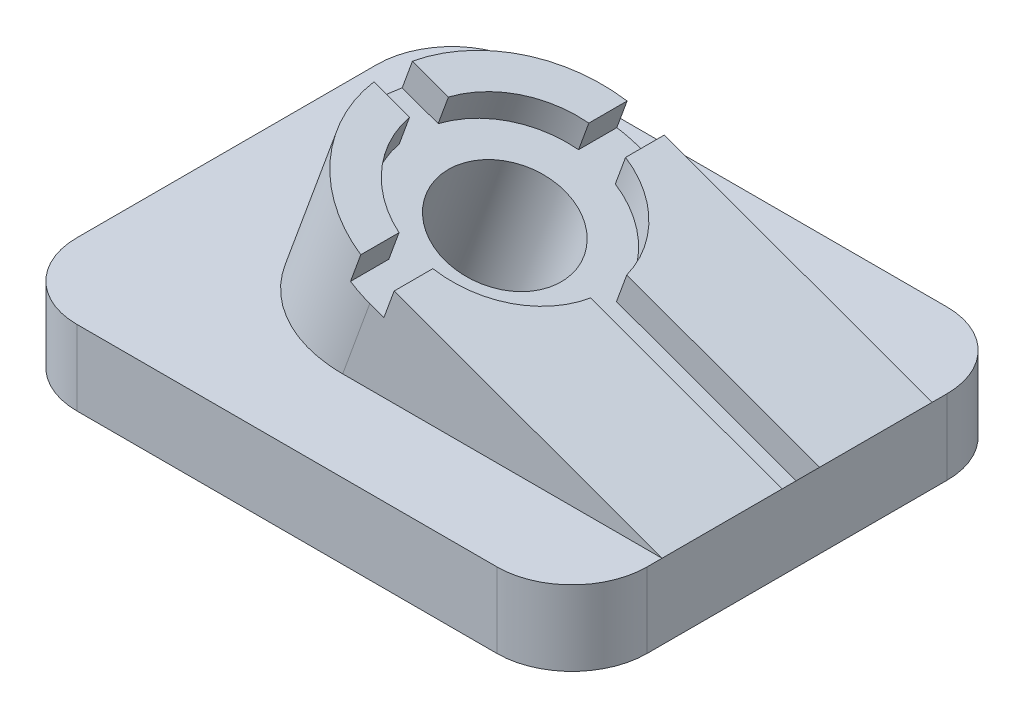
ISO-10303-21;
HEADER;
FILE_DESCRIPTION(('STEP AP214'),'2;1');
FILE_NAME('part.step','',(''),(''),'','','');
FILE_SCHEMA(('AUTOMOTIVE_DESIGN { 1 0 10303 214 1 1 1 1 }'));
ENDSEC;
DATA;
#1=APPLICATION_CONTEXT('core data for automotive mechanical design processes');
#2=APPLICATION_PROTOCOL_DEFINITION('international standard','automotive_design',2000,#1);
#3=PRODUCT_CONTEXT('',#1,'mechanical');
#4=PRODUCT('Part','Part','',(#3));
#5=PRODUCT_RELATED_PRODUCT_CATEGORY('part','',(#4));
#6=PRODUCT_DEFINITION_FORMATION('','',#4);
#7=PRODUCT_DEFINITION_CONTEXT('part definition',#1,'design');
#8=PRODUCT_DEFINITION('design','',#6,#7);
#9=PRODUCT_DEFINITION_SHAPE('','',#8);
#10=(LENGTH_UNIT() NAMED_UNIT(*) SI_UNIT(.MILLI.,.METRE.));
#11=(NAMED_UNIT(*) PLANE_ANGLE_UNIT() SI_UNIT($,.RADIAN.));
#12=(NAMED_UNIT(*) SI_UNIT($,.STERADIAN.) SOLID_ANGLE_UNIT());
#13=UNCERTAINTY_MEASURE_WITH_UNIT(LENGTH_MEASURE(1.E-05),#10,'distance_accuracy_value','');
#14=(GEOMETRIC_REPRESENTATION_CONTEXT(3) GLOBAL_UNCERTAINTY_ASSIGNED_CONTEXT((#13)) GLOBAL_UNIT_ASSIGNED_CONTEXT((#10,
#11,#12)) REPRESENTATION_CONTEXT('',''));
#15=CARTESIAN_POINT('',(0.,0.,0.));
#16=DIRECTION('',(0.,0.,1.));
#17=DIRECTION('',(1.,0.,0.));
#18=AXIS2_PLACEMENT_3D('',#15,#16,#17);
#19=CARTESIAN_POINT('',(6.0521246049556,16.6280756918416,18.));
#20=DIRECTION('',(-0.342020143325663,-0.93969262078591,0.));
#21=DIRECTION('',(0.939692620785911,-0.342020143325663,0.));
#22=AXIS2_PLACEMENT_3D('',#19,#20,#21);
#23=PLANE('',#22);
#24=DIRECTION('',(0.,0.,-1.));
#25=VECTOR('',#24,1.);
#26=CARTESIAN_POINT('',(-2.40678269379413,19.7068661630035,0.));
#27=LINE('',#26,#25);
#28=CARTESIAN_POINT('',(-2.40678269379413,19.7068661630035,17.7482393492988));
#29=VERTEX_POINT('',#28);
#30=CARTESIAN_POINT('',(-2.40678269379413,19.7068661630035,12.6491106406735));
#31=VERTEX_POINT('',#30);
#32=EDGE_CURVE('E263',#29,#31,#27,.T.);
#33=ORIENTED_EDGE('',*,*,#32,.T.);
#34=CARTESIAN_POINT('',(0.412295168563595,18.6808057330265,0.));
#35=DIRECTION('',(0.342020143325663,0.939692620785911,0.));
#36=DIRECTION('',(-0.93969262078591,0.342020143325663,0.));
#37=AXIS2_PLACEMENT_3D('',#34,#35,#36);
#38=CIRCLE('',#37,13.);
#39=CARTESIAN_POINT('',(-11.6582750978868,23.0741340206331,2.));
#40=VERTEX_POINT('',#39);
#41=EDGE_CURVE('E329',#40,#31,#38,.T.);
#42=ORIENTED_EDGE('',*,*,#41,.F.);
#43=DIRECTION('',(-0.93969262078591,0.342020143325663,0.));
#44=VECTOR('',#43,1.);
#45=CARTESIAN_POINT('',(6.0521246049556,16.6280756918416,2.));
#46=LINE('',#45,#44);
#47=CARTESIAN_POINT('',(-16.3974374556942,24.7990480542298,2.));
#48=VERTEX_POINT('',#47);
#49=EDGE_CURVE('E326',#40,#48,#46,.T.);
#50=ORIENTED_EDGE('',*,*,#49,.T.);
#51=CARTESIAN_POINT('',(0.412295168563595,18.6808057330265,0.));
#52=DIRECTION('',(0.342020143325663,0.939692620785911,0.));
#53=DIRECTION('',(-0.93969262078591,0.342020143325663,0.));
#54=AXIS2_PLACEMENT_3D('',#51,#52,#53);
#55=CIRCLE('',#54,18.);
#56=EDGE_CURVE('E370',#48,#29,#55,.T.);
#57=ORIENTED_EDGE('',*,*,#56,.T.);
#58=EDGE_LOOP('',(#33,#42,#50,#57));
#59=FACE_BOUND('',#58,.T.);
#60=ADVANCED_FACE('F58',(#59),#23,.F.);
#61=CARTESIAN_POINT('',(-2.40678269379413,19.7068661630035,-17.7482393492988));
#62=VERTEX_POINT('',#61);
#63=CARTESIAN_POINT('',(-16.2655943799147,24.7510610990519,-3.));
#64=VERTEX_POINT('',#63);
#65=EDGE_CURVE('E378',#62,#64,#55,.T.);
#66=ORIENTED_EDGE('',*,*,#65,.T.);
#67=DIRECTION('',(-0.93969262078591,0.342020143325663,0.));
#68=VECTOR('',#67,1.);
#69=CARTESIAN_POINT('',(6.0521246049556,16.6280756918416,-3.));
#70=LINE('',#69,#68);
#71=CARTESIAN_POINT('',(-11.4739807599818,23.0070563672919,-3.));
#72=VERTEX_POINT('',#71);
#73=EDGE_CURVE('E324',#72,#64,#70,.T.);
#74=ORIENTED_EDGE('',*,*,#73,.F.);
#75=CARTESIAN_POINT('',(0.412295168563595,18.6808057330265,0.));
#76=DIRECTION('',(0.342020143325663,0.939692620785911,0.));
#77=DIRECTION('',(-0.93969262078591,0.342020143325663,0.));
#78=AXIS2_PLACEMENT_3D('',#75,#76,#77);
#79=CIRCLE('',#78,13.);
#80=CARTESIAN_POINT('',(-2.40678269379413,19.7068661630035,-12.6491106406735));
#81=VERTEX_POINT('',#80);
#82=EDGE_CURVE('E321',#81,#72,#79,.T.);
#83=ORIENTED_EDGE('',*,*,#82,.F.);
#84=DIRECTION('',(0.,0.,-1.));
#85=VECTOR('',#84,1.);
#86=CARTESIAN_POINT('',(-2.40678269379413,19.7068661630035,0.));
#87=LINE('',#86,#85);
#88=EDGE_CURVE('E318',#81,#62,#87,.T.);
#89=ORIENTED_EDGE('',*,*,#88,.T.);
#90=EDGE_LOOP('',(#66,#74,#83,#89));
#91=FACE_BOUND('',#90,.T.);
#92=ADVANCED_FACE('F534',(#91),#23,.F.);
#93=DIRECTION('',(-0.939692620785911,0.342020143325663,0.));
#94=VECTOR('',#93,1.);
#95=CARTESIAN_POINT('',(6.0521246049556,16.6280756918416,-18.));
#96=LINE('',#95,#94);
#97=CARTESIAN_POINT('',(38.,5.00000000000002,-18.));
#98=VERTEX_POINT('',#97);
#99=CARTESIAN_POINT('',(2.29168041013542,17.9967654463752,-18.));
#100=VERTEX_POINT('',#99);
#101=EDGE_CURVE('E374',#98,#100,#96,.T.);
#102=ORIENTED_EDGE('',*,*,#101,.T.);
#103=DIRECTION('',(0.,0.,-1.));
#104=VECTOR('',#103,1.);
#105=CARTESIAN_POINT('',(2.29168041013542,17.9967654463752,0.));
#106=LINE('',#105,#104);
#107=CARTESIAN_POINT('',(2.29168041013542,17.9967654463752,-12.8452325786651));
#108=VERTEX_POINT('',#107);
#109=EDGE_CURVE('E316',#108,#100,#106,.T.);
#110=ORIENTED_EDGE('',*,*,#109,.F.);
#111=CARTESIAN_POINT('',(0.412295168563595,18.6808057330266,0.));
#112=DIRECTION('',(0.342020143325663,0.939692620785911,0.));
#113=DIRECTION('',(-0.93969262078591,0.342020143325663,0.));
#114=AXIS2_PLACEMENT_3D('',#111,#112,#113);
#115=CIRCLE('',#114,13.);
#116=CARTESIAN_POINT('',(12.298571097109,14.3545550987612,-3.));
#117=VERTEX_POINT('',#116);
#118=EDGE_CURVE('E313',#117,#108,#115,.T.);
#119=ORIENTED_EDGE('',*,*,#118,.F.);
#120=DIRECTION('',(-0.93969262078591,0.342020143325663,0.));
#121=VECTOR('',#120,1.);
#122=CARTESIAN_POINT('',(6.0521246049556,16.6280756918416,-3.));
#123=LINE('',#122,#121);
#124=CARTESIAN_POINT('',(38.,5.00000000000002,-3.));
#125=VERTEX_POINT('',#124);
#126=EDGE_CURVE('E310',#125,#117,#123,.T.);
#127=ORIENTED_EDGE('',*,*,#126,.F.);
#128=DIRECTION('',(0.,0.,-1.));
#129=VECTOR('',#128,1.);
#130=CARTESIAN_POINT('',(38.,5.00000000000002,18.));
#131=LINE('',#130,#129);
#132=EDGE_CURVE('E388',#125,#98,#131,.T.);
#133=ORIENTED_EDGE('',*,*,#132,.T.);
#134=EDGE_LOOP('',(#102,#110,#119,#127,#133));
#135=FACE_BOUND('',#134,.T.);
#136=ADVANCED_FACE('F505',(#135),#23,.F.);
#137=CARTESIAN_POINT('',(-14.6732677663042,-22.766437790285,0.));
#138=DIRECTION('',(0.342020143325663,0.939692620785911,0.));
#139=DIRECTION('',(-0.939692620785911,0.342020143325663,0.));
#140=AXIS2_PLACEMENT_3D('',#137,#138,#139);
#141=CYLINDRICAL_SURFACE('',#140,18.);
#142=ORIENTED_EDGE('',*,*,#65,.F.);
#143=DIRECTION('',(0.342020143325663,0.939692620785911,0.));
#144=VECTOR('',#143,1.);
#145=CARTESIAN_POINT('',(-3.77486326709679,15.9480956798599,-17.7482393492988));
#146=LINE('',#145,#144);
#147=CARTESIAN_POINT('',(-3.77486326709679,15.9480956798599,-17.7482393492988));
#148=VERTEX_POINT('',#147);
#149=EDGE_CURVE('E353',#148,#62,#146,.T.);
#150=ORIENTED_EDGE('',*,*,#149,.F.);
#151=CARTESIAN_POINT('',(-0.955785404739057,14.9220352498829,0.));
#152=DIRECTION('',(0.342020143325663,0.939692620785911,0.));
#153=DIRECTION('',(-0.93969262078591,0.342020143325663,0.));
#154=AXIS2_PLACEMENT_3D('',#151,#152,#153);
#155=CIRCLE('',#154,18.);
#156=CARTESIAN_POINT('',(-0.955785404739058,14.9220352498829,-18.));
#157=VERTEX_POINT('',#156);
#158=EDGE_CURVE('E281',#157,#148,#155,.T.);
#159=ORIENTED_EDGE('',*,*,#158,.F.);
#160=DIRECTION('',(0.342020143325663,0.939692620785911,0.));
#161=VECTOR('',#160,1.);
#162=CARTESIAN_POINT('',(-14.6732677663042,-22.766437790285,-18.));
#163=LINE('',#162,#161);
#164=CARTESIAN_POINT('',(-4.56711089903638,5.00000000000001,-18.));
#165=VERTEX_POINT('',#164);
#166=EDGE_CURVE('E375',#165,#157,#163,.T.);
#167=ORIENTED_EDGE('',*,*,#166,.F.);
#168=CARTESIAN_POINT('',(-4.56711089903638,5.00000000000001,0.));
#169=DIRECTION('',(0.,1.,0.));
#170=DIRECTION('',(1.,0.,0.));
#171=AXIS2_PLACEMENT_3D('',#168,#169,#170);
#172=ELLIPSE('',#171,19.1551999045664,18.);
#173=CARTESIAN_POINT('',(-4.56711089903638,5.00000000000001,18.));
#174=VERTEX_POINT('',#173);
#175=EDGE_CURVE('E371',#174,#165,#172,.F.);
#176=ORIENTED_EDGE('',*,*,#175,.F.);
#177=DIRECTION('',(0.342020143325663,0.939692620785911,0.));
#178=VECTOR('',#177,1.);
#179=CARTESIAN_POINT('',(-14.6732677663042,-22.766437790285,18.));
#180=LINE('',#179,#178);
#181=CARTESIAN_POINT('',(-0.955785404739058,14.9220352498829,18.));
#182=VERTEX_POINT('',#181);
#183=EDGE_CURVE('E367',#174,#182,#180,.T.);
#184=ORIENTED_EDGE('',*,*,#183,.T.);
#185=CARTESIAN_POINT('',(-3.77486326709679,15.9480956798599,17.7482393492988));
#186=VERTEX_POINT('',#185);
#187=EDGE_CURVE('E285',#186,#182,#155,.T.);
#188=ORIENTED_EDGE('',*,*,#187,.F.);
#189=DIRECTION('',(0.342020143325663,0.939692620785911,0.));
#190=VECTOR('',#189,1.);
#191=CARTESIAN_POINT('',(-3.77486326709679,15.9480956798599,17.7482393492988));
#192=LINE('',#191,#190);
#193=EDGE_CURVE('E337',#186,#29,#192,.T.);
#194=ORIENTED_EDGE('',*,*,#193,.T.);
#195=ORIENTED_EDGE('',*,*,#56,.F.);
#196=DIRECTION('',(0.342020143325663,0.939692620785911,0.));
#197=VECTOR('',#196,1.);
#198=CARTESIAN_POINT('',(-17.7655180289969,21.0402775710861,2.));
#199=LINE('',#198,#197);
#200=CARTESIAN_POINT('',(-17.7655180289969,21.0402775710861,2.));
#201=VERTEX_POINT('',#200);
#202=EDGE_CURVE('E344',#201,#48,#199,.T.);
#203=ORIENTED_EDGE('',*,*,#202,.F.);
#204=CARTESIAN_POINT('',(-17.6336749532173,20.9922906159083,-3.));
#205=VERTEX_POINT('',#204);
#206=EDGE_CURVE('E286',#205,#201,#155,.T.);
#207=ORIENTED_EDGE('',*,*,#206,.F.);
#208=DIRECTION('',(0.342020143325663,0.939692620785911,0.));
#209=VECTOR('',#208,1.);
#210=CARTESIAN_POINT('',(-17.6336749532173,20.9922906159083,-3.));
#211=LINE('',#210,#209);
#212=EDGE_CURVE('E346',#205,#64,#211,.T.);
#213=ORIENTED_EDGE('',*,*,#212,.T.);
#214=EDGE_LOOP('',(#142,#150,#159,#167,#176,#184,#188,#194,#195,#203,#207,#213));
#215=FACE_BOUND('',#214,.T.);
#216=ADVANCED_FACE('F550',(#215),#141,.T.);
#217=CARTESIAN_POINT('',(-11.6919540413476,-14.5753456506566,0.));
#218=DIRECTION('',(0.342020143325663,0.939692620785911,0.));
#219=DIRECTION('',(-0.93969262078591,0.342020143325663,0.));
#220=AXIS2_PLACEMENT_3D('',#217,#218,#219);
#221=CYLINDRICAL_SURFACE('',#220,8.);
#222=CARTESIAN_POINT('',(-8.20681324169835,-5.00000000000001,0.));
#223=DIRECTION('',(0.,-1.,0.));
#224=DIRECTION('',(1.,0.,0.));
#225=AXIS2_PLACEMENT_3D('',#222,#223,#224);
#226=ELLIPSE('',#225,8.51342217980728,8.);
#227=CARTESIAN_POINT('',(0.306608938108932,-5.00000000000001,0.));
#228=VERTEX_POINT('',#227);
#229=EDGE_CURVE('E336',#228,#228,#226,.T.);
#230=ORIENTED_EDGE('',*,*,#229,.T.);
#231=EDGE_LOOP('',(#230));
#232=FACE_BOUND('',#231,.T.);
#233=CARTESIAN_POINT('',(-0.955785404739057,14.9220352498829,0.));
#234=DIRECTION('',(0.342020143325663,0.939692620785911,0.));
#235=DIRECTION('',(-0.93969262078591,0.342020143325663,0.));
#236=AXIS2_PLACEMENT_3D('',#233,#234,#235);
#237=CIRCLE('',#236,8.);
#238=CARTESIAN_POINT('',(-8.47332637102634,17.6581963964882,0.));
#239=VERTEX_POINT('',#238);
#240=EDGE_CURVE('E260',#239,#239,#237,.T.);
#241=ORIENTED_EDGE('',*,*,#240,.T.);
#242=EDGE_LOOP('',(#241));
#243=FACE_BOUND('',#242,.T.);
#244=ADVANCED_FACE('F544',(#232,#243),#221,.F.);
#245=CARTESIAN_POINT('',(0.412295168563595,18.6808057330266,0.));
#246=DIRECTION('',(0.342020143325663,0.939692620785911,0.));
#247=DIRECTION('',(-0.93969262078591,0.342020143325663,0.));
#248=AXIS2_PLACEMENT_3D('',#245,#246,#247);
#249=CIRCLE('',#248,13.);
#250=CARTESIAN_POINT('',(2.29168041013542,17.9967654463752,12.8452325786651));
#251=VERTEX_POINT('',#250);
#252=CARTESIAN_POINT('',(12.482865435014,14.28747744542,2.));
#253=VERTEX_POINT('',#252);
#254=EDGE_CURVE('E302',#251,#253,#249,.T.);
#255=ORIENTED_EDGE('',*,*,#254,.F.);
#256=DIRECTION('',(0.,0.,-1.));
#257=VECTOR('',#256,1.);
#258=CARTESIAN_POINT('',(2.29168041013541,17.9967654463752,0.));
#259=LINE('',#258,#257);
#260=CARTESIAN_POINT('',(2.29168041013542,17.9967654463752,18.));
#261=VERTEX_POINT('',#260);
#262=EDGE_CURVE('E242',#261,#251,#259,.T.);
#263=ORIENTED_EDGE('',*,*,#262,.F.);
#264=DIRECTION('',(-0.939692620785911,0.342020143325663,0.));
#265=VECTOR('',#264,1.);
#266=CARTESIAN_POINT('',(6.0521246049556,16.6280756918416,18.));
#267=LINE('',#266,#265);
#268=CARTESIAN_POINT('',(38.,5.00000000000002,18.));
#269=VERTEX_POINT('',#268);
#270=EDGE_CURVE('E381',#269,#261,#267,.T.);
#271=ORIENTED_EDGE('',*,*,#270,.F.);
#272=CARTESIAN_POINT('',(38.,5.00000000000002,2.));
#273=VERTEX_POINT('',#272);
#274=EDGE_CURVE('E393',#269,#273,#131,.T.);
#275=ORIENTED_EDGE('',*,*,#274,.T.);
#276=DIRECTION('',(-0.93969262078591,0.342020143325663,0.));
#277=VECTOR('',#276,1.);
#278=CARTESIAN_POINT('',(6.0521246049556,16.6280756918416,2.));
#279=LINE('',#278,#277);
#280=EDGE_CURVE('E304',#273,#253,#279,.T.);
#281=ORIENTED_EDGE('',*,*,#280,.T.);
#282=EDGE_LOOP('',(#255,#263,#271,#275,#281));
#283=FACE_BOUND('',#282,.T.);
#284=ADVANCED_FACE('F494',(#283),#23,.F.);
#285=CARTESIAN_POINT('',(0.,5.00000000000002,30.));
#286=DIRECTION('',(0.,1.,0.));
#287=DIRECTION('',(-1.,0.,0.));
#288=AXIS2_PLACEMENT_3D('',#285,#286,#287);
#289=PLANE('',#288);
#290=DIRECTION('',(1.,0.,0.));
#291=VECTOR('',#290,1.);
#292=CARTESIAN_POINT('',(0.,5.00000000000002,-30.));
#293=LINE('',#292,#291);
#294=CARTESIAN_POINT('',(-28.,5.00000000000001,-30.));
#295=VERTEX_POINT('',#294);
#296=CARTESIAN_POINT('',(28.,5.00000000000002,-30.));
#297=VERTEX_POINT('',#296);
#298=EDGE_CURVE('E400',#295,#297,#293,.T.);
#299=ORIENTED_EDGE('',*,*,#298,.F.);
#300=CARTESIAN_POINT('',(-28.,5.00000000000001,-20.));
#301=DIRECTION('',(0.,1.,0.));
#302=DIRECTION('',(-1.,0.,0.));
#303=AXIS2_PLACEMENT_3D('',#300,#301,#302);
#304=CIRCLE('',#303,10.);
#305=CARTESIAN_POINT('',(-38.,5.00000000000001,-20.));
#306=VERTEX_POINT('',#305);
#307=EDGE_CURVE('E433',#295,#306,#304,.T.);
#308=ORIENTED_EDGE('',*,*,#307,.T.);
#309=DIRECTION('',(0.,0.,-1.));
#310=VECTOR('',#309,1.);
#311=CARTESIAN_POINT('',(-38.,5.00000000000001,30.));
#312=LINE('',#311,#310);
#313=CARTESIAN_POINT('',(-38.,5.00000000000001,20.));
#314=VERTEX_POINT('',#313);
#315=EDGE_CURVE('E403',#314,#306,#312,.T.);
#316=ORIENTED_EDGE('',*,*,#315,.F.);
#317=CARTESIAN_POINT('',(-28.,5.00000000000001,20.));
#318=DIRECTION('',(0.,1.,0.));
#319=DIRECTION('',(-1.,0.,0.));
#320=AXIS2_PLACEMENT_3D('',#317,#318,#319);
#321=CIRCLE('',#320,10.);
#322=CARTESIAN_POINT('',(-28.,5.00000000000001,30.));
#323=VERTEX_POINT('',#322);
#324=EDGE_CURVE('E427',#314,#323,#321,.T.);
#325=ORIENTED_EDGE('',*,*,#324,.T.);
#326=DIRECTION('',(1.,0.,0.));
#327=VECTOR('',#326,1.);
#328=CARTESIAN_POINT('',(0.,5.00000000000002,30.));
#329=LINE('',#328,#327);
#330=CARTESIAN_POINT('',(28.,5.00000000000002,30.));
#331=VERTEX_POINT('',#330);
#332=EDGE_CURVE('E399',#323,#331,#329,.T.);
#333=ORIENTED_EDGE('',*,*,#332,.T.);
#334=CARTESIAN_POINT('',(28.,5.00000000000002,20.));
#335=DIRECTION('',(0.,1.,0.));
#336=DIRECTION('',(-1.,0.,0.));
#337=AXIS2_PLACEMENT_3D('',#334,#335,#336);
#338=CIRCLE('',#337,10.);
#339=CARTESIAN_POINT('',(38.,5.00000000000002,20.));
#340=VERTEX_POINT('',#339);
#341=EDGE_CURVE('E429',#331,#340,#338,.T.);
#342=ORIENTED_EDGE('',*,*,#341,.T.);
#343=DIRECTION('',(0.,0.,-1.));
#344=VECTOR('',#343,1.);
#345=CARTESIAN_POINT('',(38.,5.00000000000002,30.));
#346=LINE('',#345,#344);
#347=EDGE_CURVE('E411',#340,#269,#346,.T.);
#348=ORIENTED_EDGE('',*,*,#347,.T.);
#349=DIRECTION('',(1.,0.,0.));
#350=VECTOR('',#349,1.);
#351=CARTESIAN_POINT('',(0.,5.00000000000002,18.));
#352=LINE('',#351,#350);
#353=EDGE_CURVE('E384',#174,#269,#352,.T.);
#354=ORIENTED_EDGE('',*,*,#353,.F.);
#355=ORIENTED_EDGE('',*,*,#175,.T.);
#356=DIRECTION('',(1.,0.,0.));
#357=VECTOR('',#356,1.);
#358=CARTESIAN_POINT('',(0.,5.00000000000002,-18.));
#359=LINE('',#358,#357);
#360=EDGE_CURVE('E385',#165,#98,#359,.T.);
#361=ORIENTED_EDGE('',*,*,#360,.T.);
#362=CARTESIAN_POINT('',(38.,5.00000000000002,-20.));
#363=VERTEX_POINT('',#362);
#364=EDGE_CURVE('E410',#98,#363,#346,.T.);
#365=ORIENTED_EDGE('',*,*,#364,.T.);
#366=CARTESIAN_POINT('',(28.,5.00000000000002,-20.));
#367=DIRECTION('',(0.,1.,0.));
#368=DIRECTION('',(-1.,0.,0.));
#369=AXIS2_PLACEMENT_3D('',#366,#367,#368);
#370=CIRCLE('',#369,10.);
#371=EDGE_CURVE('E431',#363,#297,#370,.T.);
#372=ORIENTED_EDGE('',*,*,#371,.T.);
#373=EDGE_LOOP('',(#299,#308,#316,#325,#333,#342,#348,#354,#355,#361,#365,#372));
#374=FACE_BOUND('',#373,.T.);
#375=ADVANCED_FACE('F461',(#374),#289,.T.);
#376=CARTESIAN_POINT('',(-38.,0.,30.));
#377=DIRECTION('',(-1.,0.,0.));
#378=DIRECTION('',(0.,0.,1.));
#379=AXIS2_PLACEMENT_3D('',#376,#377,#378);
#380=PLANE('',#379);
#381=ORIENTED_EDGE('',*,*,#315,.T.);
#382=DIRECTION('',(0.,1.,0.));
#383=VECTOR('',#382,1.);
#384=CARTESIAN_POINT('',(-38.,-5.00000000000001,-20.));
#385=LINE('',#384,#383);
#386=CARTESIAN_POINT('',(-38.,-5.00000000000001,-20.));
#387=VERTEX_POINT('',#386);
#388=EDGE_CURVE('E438',#306,#387,#385,.F.);
#389=ORIENTED_EDGE('',*,*,#388,.T.);
#390=DIRECTION('',(0.,0.,-1.));
#391=VECTOR('',#390,1.);
#392=CARTESIAN_POINT('',(-38.,-5.00000000000001,30.));
#393=LINE('',#392,#391);
#394=CARTESIAN_POINT('',(-38.,-5.00000000000001,20.));
#395=VERTEX_POINT('',#394);
#396=EDGE_CURVE('E416',#395,#387,#393,.T.);
#397=ORIENTED_EDGE('',*,*,#396,.F.);
#398=DIRECTION('',(0.,1.,0.));
#399=VECTOR('',#398,1.);
#400=CARTESIAN_POINT('',(-38.,0.,20.));
#401=LINE('',#400,#399);
#402=EDGE_CURVE('E435',#395,#314,#401,.T.);
#403=ORIENTED_EDGE('',*,*,#402,.T.);
#404=EDGE_LOOP('',(#381,#389,#397,#403));
#405=FACE_BOUND('',#404,.T.);
#406=ADVANCED_FACE('F478',(#405),#380,.T.);
#407=CARTESIAN_POINT('',(0.,-5.00000000000001,30.));
#408=DIRECTION('',(0.,-1.,0.));
#409=DIRECTION('',(1.,0.,0.));
#410=AXIS2_PLACEMENT_3D('',#407,#408,#409);
#411=PLANE('',#410);
#412=ORIENTED_EDGE('',*,*,#229,.F.);
#413=EDGE_LOOP('',(#412));
#414=FACE_BOUND('',#413,.T.);
#415=ORIENTED_EDGE('',*,*,#396,.T.);
#416=CARTESIAN_POINT('',(-28.,-5.00000000000001,-20.));
#417=DIRECTION('',(0.,-1.,0.));
#418=DIRECTION('',(1.,0.,0.));
#419=AXIS2_PLACEMENT_3D('',#416,#417,#418);
#420=CIRCLE('',#419,10.);
#421=CARTESIAN_POINT('',(-28.,-5.00000000000001,-30.));
#422=VERTEX_POINT('',#421);
#423=EDGE_CURVE('E445',#387,#422,#420,.T.);
#424=ORIENTED_EDGE('',*,*,#423,.T.);
#425=DIRECTION('',(-1.,0.,0.));
#426=VECTOR('',#425,1.);
#427=CARTESIAN_POINT('',(0.,-5.00000000000001,-30.));
#428=LINE('',#427,#426);
#429=CARTESIAN_POINT('',(28.,-5.,-30.));
#430=VERTEX_POINT('',#429);
#431=EDGE_CURVE('E396',#430,#422,#428,.T.);
#432=ORIENTED_EDGE('',*,*,#431,.F.);
#433=CARTESIAN_POINT('',(28.,-5.,-20.));
#434=DIRECTION('',(0.,-1.,0.));
#435=DIRECTION('',(1.,0.,0.));
#436=AXIS2_PLACEMENT_3D('',#433,#434,#435);
#437=CIRCLE('',#436,10.);
#438=CARTESIAN_POINT('',(38.,-5.,-20.));
#439=VERTEX_POINT('',#438);
#440=EDGE_CURVE('E443',#430,#439,#437,.T.);
#441=ORIENTED_EDGE('',*,*,#440,.T.);
#442=DIRECTION('',(0.,0.,-1.));
#443=VECTOR('',#442,1.);
#444=CARTESIAN_POINT('',(38.,-5.,30.));
#445=LINE('',#444,#443);
#446=CARTESIAN_POINT('',(38.,-5.,20.));
#447=VERTEX_POINT('',#446);
#448=EDGE_CURVE('E413',#447,#439,#445,.T.);
#449=ORIENTED_EDGE('',*,*,#448,.F.);
#450=CARTESIAN_POINT('',(28.,-5.,20.));
#451=DIRECTION('',(0.,-1.,0.));
#452=DIRECTION('',(1.,0.,0.));
#453=AXIS2_PLACEMENT_3D('',#450,#451,#452);
#454=CIRCLE('',#453,10.);
#455=CARTESIAN_POINT('',(28.,-5.,30.));
#456=VERTEX_POINT('',#455);
#457=EDGE_CURVE('E79',#447,#456,#454,.T.);
#458=ORIENTED_EDGE('',*,*,#457,.T.);
#459=DIRECTION('',(-1.,0.,0.));
#460=VECTOR('',#459,1.);
#461=CARTESIAN_POINT('',(0.,-5.00000000000001,30.));
#462=LINE('',#461,#460);
#463=CARTESIAN_POINT('',(-28.,-5.00000000000001,30.));
#464=VERTEX_POINT('',#463);
#465=EDGE_CURVE('E397',#456,#464,#462,.T.);
#466=ORIENTED_EDGE('',*,*,#465,.T.);
#467=CARTESIAN_POINT('',(-28.,-5.00000000000001,20.));
#468=DIRECTION('',(0.,-1.,0.));
#469=DIRECTION('',(1.,0.,0.));
#470=AXIS2_PLACEMENT_3D('',#467,#468,#469);
#471=CIRCLE('',#470,10.);
#472=EDGE_CURVE('E440',#464,#395,#471,.T.);
#473=ORIENTED_EDGE('',*,*,#472,.T.);
#474=EDGE_LOOP('',(#415,#424,#432,#441,#449,#458,#466,#473));
#475=FACE_BOUND('',#474,.T.);
#476=ADVANCED_FACE('F470',(#414,#475),#411,.T.);
#477=CARTESIAN_POINT('',(38.,0.,30.));
#478=DIRECTION('',(1.,0.,0.));
#479=DIRECTION('',(0.,0.,-1.));
#480=AXIS2_PLACEMENT_3D('',#477,#478,#479);
#481=PLANE('',#480);
#482=ORIENTED_EDGE('',*,*,#448,.T.);
#483=DIRECTION('',(0.,-1.,0.));
#484=VECTOR('',#483,1.);
#485=CARTESIAN_POINT('',(38.,5.00000000000002,-20.));
#486=LINE('',#485,#484);
#487=EDGE_CURVE('E450',#439,#363,#486,.F.);
#488=ORIENTED_EDGE('',*,*,#487,.T.);
#489=ORIENTED_EDGE('',*,*,#364,.F.);
#490=ORIENTED_EDGE('',*,*,#132,.F.);
#491=DIRECTION('',(0.,0.,-1.));
#492=VECTOR('',#491,1.);
#493=CARTESIAN_POINT('',(38.,5.00000000000002,0.));
#494=LINE('',#493,#492);
#495=EDGE_CURVE('E307',#273,#125,#494,.T.);
#496=ORIENTED_EDGE('',*,*,#495,.F.);
#497=ORIENTED_EDGE('',*,*,#274,.F.);
#498=ORIENTED_EDGE('',*,*,#347,.F.);
#499=DIRECTION('',(0.,-1.,0.));
#500=VECTOR('',#499,1.);
#501=CARTESIAN_POINT('',(38.,0.,20.));
#502=LINE('',#501,#500);
#503=EDGE_CURVE('E447',#340,#447,#502,.T.);
#504=ORIENTED_EDGE('',*,*,#503,.T.);
#505=EDGE_LOOP('',(#482,#488,#489,#490,#496,#497,#498,#504));
#506=FACE_BOUND('',#505,.T.);
#507=ADVANCED_FACE('F455',(#506),#481,.T.);
#508=CARTESIAN_POINT('',(0.,0.,30.));
#509=DIRECTION('',(0.,0.,1.));
#510=DIRECTION('',(1.,0.,0.));
#511=AXIS2_PLACEMENT_3D('',#508,#509,#510);
#512=PLANE('',#511);
#513=ORIENTED_EDGE('',*,*,#465,.F.);
#514=DIRECTION('',(0.,-1.,0.));
#515=VECTOR('',#514,1.);
#516=CARTESIAN_POINT('',(28.,0.,30.));
#517=LINE('',#516,#515);
#518=EDGE_CURVE('E12',#456,#331,#517,.F.);
#519=ORIENTED_EDGE('',*,*,#518,.T.);
#520=ORIENTED_EDGE('',*,*,#332,.F.);
#521=DIRECTION('',(0.,1.,0.));
#522=VECTOR('',#521,1.);
#523=CARTESIAN_POINT('',(-28.,0.,30.));
#524=LINE('',#523,#522);
#525=EDGE_CURVE('E66',#323,#464,#524,.F.);
#526=ORIENTED_EDGE('',*,*,#525,.T.);
#527=EDGE_LOOP('',(#513,#519,#520,#526));
#528=FACE_BOUND('',#527,.T.);
#529=ADVANCED_FACE('F483',(#528),#512,.T.);
#530=CARTESIAN_POINT('',(0.,0.,-30.));
#531=DIRECTION('',(0.,0.,1.));
#532=DIRECTION('',(1.,0.,0.));
#533=AXIS2_PLACEMENT_3D('',#530,#531,#532);
#534=PLANE('',#533);
#535=ORIENTED_EDGE('',*,*,#431,.T.);
#536=DIRECTION('',(0.,1.,0.));
#537=VECTOR('',#536,1.);
#538=CARTESIAN_POINT('',(-28.,5.00000000000001,-30.));
#539=LINE('',#538,#537);
#540=EDGE_CURVE('E424',#422,#295,#539,.T.);
#541=ORIENTED_EDGE('',*,*,#540,.T.);
#542=ORIENTED_EDGE('',*,*,#298,.T.);
#543=DIRECTION('',(0.,-1.,0.));
#544=VECTOR('',#543,1.);
#545=CARTESIAN_POINT('',(28.,-5.,-30.));
#546=LINE('',#545,#544);
#547=EDGE_CURVE('E419',#297,#430,#546,.T.);
#548=ORIENTED_EDGE('',*,*,#547,.T.);
#549=EDGE_LOOP('',(#535,#541,#542,#548));
#550=FACE_BOUND('',#549,.T.);
#551=ADVANCED_FACE('F468',(#550),#534,.F.);
#552=CARTESIAN_POINT('',(0.,0.,18.));
#553=DIRECTION('',(0.,0.,1.));
#554=DIRECTION('',(1.,0.,0.));
#555=AXIS2_PLACEMENT_3D('',#552,#553,#554);
#556=PLANE('',#555);
#557=DIRECTION('',(0.342020143325663,0.939692620785911,0.));
#558=VECTOR('',#557,1.);
#559=CARTESIAN_POINT('',(0.923599836832766,14.2379949632316,18.));
#560=LINE('',#559,#558);
#561=CARTESIAN_POINT('',(0.923599836832766,14.2379949632316,18.));
#562=VERTEX_POINT('',#561);
#563=EDGE_CURVE('E334',#562,#261,#560,.T.);
#564=ORIENTED_EDGE('',*,*,#563,.F.);
#565=DIRECTION('',(0.93969262078591,-0.342020143325663,0.));
#566=VECTOR('',#565,1.);
#567=CARTESIAN_POINT('',(4.68404403165295,12.8693052086979,18.));
#568=LINE('',#567,#566);
#569=EDGE_CURVE('E247',#182,#562,#568,.T.);
#570=ORIENTED_EDGE('',*,*,#569,.F.);
#571=ORIENTED_EDGE('',*,*,#183,.F.);
#572=ORIENTED_EDGE('',*,*,#353,.T.);
#573=ORIENTED_EDGE('',*,*,#270,.T.);
#574=EDGE_LOOP('',(#564,#570,#571,#572,#573));
#575=FACE_BOUND('',#574,.T.);
#576=ADVANCED_FACE('F497',(#575),#556,.T.);
#577=CARTESIAN_POINT('',(0.,0.,-18.));
#578=DIRECTION('',(0.,0.,1.));
#579=DIRECTION('',(1.,0.,0.));
#580=AXIS2_PLACEMENT_3D('',#577,#578,#579);
#581=PLANE('',#580);
#582=DIRECTION('',(-0.93969262078591,0.342020143325663,0.));
#583=VECTOR('',#582,1.);
#584=CARTESIAN_POINT('',(4.68404403165295,12.8693052086979,-18.));
#585=LINE('',#584,#583);
#586=CARTESIAN_POINT('',(0.923599836832767,14.2379949632316,-18.));
#587=VERTEX_POINT('',#586);
#588=EDGE_CURVE('E279',#587,#157,#585,.T.);
#589=ORIENTED_EDGE('',*,*,#588,.F.);
#590=DIRECTION('',(0.342020143325663,0.939692620785911,0.));
#591=VECTOR('',#590,1.);
#592=CARTESIAN_POINT('',(0.923599836832767,14.2379949632316,-18.));
#593=LINE('',#592,#591);
#594=EDGE_CURVE('E355',#587,#100,#593,.T.);
#595=ORIENTED_EDGE('',*,*,#594,.T.);
#596=ORIENTED_EDGE('',*,*,#101,.F.);
#597=ORIENTED_EDGE('',*,*,#360,.F.);
#598=ORIENTED_EDGE('',*,*,#166,.T.);
#599=EDGE_LOOP('',(#589,#595,#596,#597,#598));
#600=FACE_BOUND('',#599,.T.);
#601=ADVANCED_FACE('F502',(#600),#581,.F.);
#602=CARTESIAN_POINT('',(0.92359983683276,14.2379949632316,0.));
#603=DIRECTION('',(0.939692620785911,-0.342020143325663,0.));
#604=DIRECTION('',(0.342020143325663,0.939692620785911,0.));
#605=AXIS2_PLACEMENT_3D('',#602,#603,#604);
#606=PLANE('',#605);
#607=ORIENTED_EDGE('',*,*,#262,.T.);
#608=DIRECTION('',(0.342020143325663,0.939692620785911,0.));
#609=VECTOR('',#608,1.);
#610=CARTESIAN_POINT('',(0.923599836832765,14.2379949632316,12.8452325786651));
#611=LINE('',#610,#609);
#612=CARTESIAN_POINT('',(0.923599836832765,14.2379949632316,12.8452325786651));
#613=VERTEX_POINT('',#612);
#614=EDGE_CURVE('E235',#613,#251,#611,.T.);
#615=ORIENTED_EDGE('',*,*,#614,.F.);
#616=DIRECTION('',(0.,0.,-1.));
#617=VECTOR('',#616,1.);
#618=CARTESIAN_POINT('',(0.92359983683276,14.2379949632316,0.));
#619=LINE('',#618,#617);
#620=EDGE_CURVE('E239',#562,#613,#619,.T.);
#621=ORIENTED_EDGE('',*,*,#620,.F.);
#622=ORIENTED_EDGE('',*,*,#563,.T.);
#623=EDGE_LOOP('',(#607,#615,#621,#622));
#624=FACE_BOUND('',#623,.T.);
#625=ADVANCED_FACE('F237',(#624),#606,.F.);
#626=CARTESIAN_POINT('',(-3.77486326709679,15.9480956798599,0.));
#627=DIRECTION('',(0.939692620785911,-0.342020143325663,0.));
#628=DIRECTION('',(0.342020143325663,0.939692620785911,0.));
#629=AXIS2_PLACEMENT_3D('',#626,#627,#628);
#630=PLANE('',#629);
#631=ORIENTED_EDGE('',*,*,#32,.F.);
#632=ORIENTED_EDGE('',*,*,#193,.F.);
#633=DIRECTION('',(0.,0.,-1.));
#634=VECTOR('',#633,1.);
#635=CARTESIAN_POINT('',(-3.77486326709679,15.9480956798599,0.));
#636=LINE('',#635,#634);
#637=CARTESIAN_POINT('',(-3.77486326709679,15.9480956798599,12.6491106406735));
#638=VERTEX_POINT('',#637);
#639=EDGE_CURVE('E298',#186,#638,#636,.T.);
#640=ORIENTED_EDGE('',*,*,#639,.T.);
#641=DIRECTION('',(0.342020143325663,0.939692620785911,0.));
#642=VECTOR('',#641,1.);
#643=CARTESIAN_POINT('',(-3.77486326709679,15.9480956798599,12.6491106406735));
#644=LINE('',#643,#642);
#645=EDGE_CURVE('E340',#638,#31,#644,.T.);
#646=ORIENTED_EDGE('',*,*,#645,.T.);
#647=EDGE_LOOP('',(#631,#632,#640,#646));
#648=FACE_BOUND('',#647,.T.);
#649=ADVANCED_FACE('F568',(#648),#630,.T.);
#650=CARTESIAN_POINT('',(-0.955785404739057,14.9220352498829,0.));
#651=DIRECTION('',(0.342020143325663,0.939692620785911,0.));
#652=DIRECTION('',(-0.939692620785911,0.342020143325663,0.));
#653=AXIS2_PLACEMENT_3D('',#650,#651,#652);
#654=CYLINDRICAL_SURFACE('',#653,13.);
#655=ORIENTED_EDGE('',*,*,#41,.T.);
#656=ORIENTED_EDGE('',*,*,#645,.F.);
#657=CARTESIAN_POINT('',(-0.955785404739057,14.9220352498829,0.));
#658=DIRECTION('',(0.342020143325663,0.939692620785911,0.));
#659=DIRECTION('',(-0.93969262078591,0.342020143325663,0.));
#660=AXIS2_PLACEMENT_3D('',#657,#658,#659);
#661=CIRCLE('',#660,13.);
#662=CARTESIAN_POINT('',(-13.0263556711895,19.3153635374894,2.));
#663=VERTEX_POINT('',#662);
#664=EDGE_CURVE('E295',#663,#638,#661,.T.);
#665=ORIENTED_EDGE('',*,*,#664,.F.);
#666=DIRECTION('',(0.342020143325663,0.939692620785911,0.));
#667=VECTOR('',#666,1.);
#668=CARTESIAN_POINT('',(-13.0263556711895,19.3153635374894,2.));
#669=LINE('',#668,#667);
#670=EDGE_CURVE('E342',#663,#40,#669,.T.);
#671=ORIENTED_EDGE('',*,*,#670,.T.);
#672=EDGE_LOOP('',(#655,#656,#665,#671));
#673=FACE_BOUND('',#672,.T.);
#674=ADVANCED_FACE('F572',(#673),#654,.F.);
#675=CARTESIAN_POINT('',(4.68404403165295,12.8693052086979,2.));
#676=DIRECTION('',(0.,0.,-1.));
#677=DIRECTION('',(-1.,0.,0.));
#678=AXIS2_PLACEMENT_3D('',#675,#676,#677);
#679=PLANE('',#678);
#680=ORIENTED_EDGE('',*,*,#49,.F.);
#681=ORIENTED_EDGE('',*,*,#670,.F.);
#682=DIRECTION('',(-0.93969262078591,0.342020143325663,0.));
#683=VECTOR('',#682,1.);
#684=CARTESIAN_POINT('',(4.68404403165295,12.8693052086979,2.));
#685=LINE('',#684,#683);
#686=EDGE_CURVE('E293',#663,#201,#685,.T.);
#687=ORIENTED_EDGE('',*,*,#686,.T.);
#688=ORIENTED_EDGE('',*,*,#202,.T.);
#689=EDGE_LOOP('',(#680,#681,#687,#688));
#690=FACE_BOUND('',#689,.T.);
#691=ADVANCED_FACE('F678',(#690),#679,.T.);
#692=CARTESIAN_POINT('',(4.68404403165295,12.8693052086979,-3.));
#693=DIRECTION('',(0.,0.,-1.));
#694=DIRECTION('',(-1.,0.,0.));
#695=AXIS2_PLACEMENT_3D('',#692,#693,#694);
#696=PLANE('',#695);
#697=ORIENTED_EDGE('',*,*,#73,.T.);
#698=ORIENTED_EDGE('',*,*,#212,.F.);
#699=DIRECTION('',(-0.93969262078591,0.342020143325663,0.));
#700=VECTOR('',#699,1.);
#701=CARTESIAN_POINT('',(4.68404403165295,12.8693052086979,-3.));
#702=LINE('',#701,#700);
#703=CARTESIAN_POINT('',(-12.8420613332845,19.2482858841482,-3.));
#704=VERTEX_POINT('',#703);
#705=EDGE_CURVE('E291',#704,#205,#702,.T.);
#706=ORIENTED_EDGE('',*,*,#705,.F.);
#707=DIRECTION('',(0.342020143325663,0.939692620785911,0.));
#708=VECTOR('',#707,1.);
#709=CARTESIAN_POINT('',(-12.8420613332845,19.2482858841482,-3.));
#710=LINE('',#709,#708);
#711=EDGE_CURVE('E349',#704,#72,#710,.T.);
#712=ORIENTED_EDGE('',*,*,#711,.T.);
#713=EDGE_LOOP('',(#697,#698,#706,#712));
#714=FACE_BOUND('',#713,.T.);
#715=ADVANCED_FACE('F669',(#714),#696,.F.);
#716=CARTESIAN_POINT('',(-0.955785404739057,14.9220352498829,0.));
#717=DIRECTION('',(0.342020143325663,0.939692620785911,0.));
#718=DIRECTION('',(-0.939692620785911,0.342020143325663,0.));
#719=AXIS2_PLACEMENT_3D('',#716,#717,#718);
#720=CYLINDRICAL_SURFACE('',#719,13.);
#721=ORIENTED_EDGE('',*,*,#82,.T.);
#722=ORIENTED_EDGE('',*,*,#711,.F.);
#723=CARTESIAN_POINT('',(-0.955785404739057,14.9220352498829,0.));
#724=DIRECTION('',(0.342020143325663,0.939692620785911,0.));
#725=DIRECTION('',(-0.93969262078591,0.342020143325663,0.));
#726=AXIS2_PLACEMENT_3D('',#723,#724,#725);
#727=CIRCLE('',#726,13.);
#728=CARTESIAN_POINT('',(-3.77486326709679,15.9480956798599,-12.6491106406735));
#729=VERTEX_POINT('',#728);
#730=EDGE_CURVE('E288',#729,#704,#727,.T.);
#731=ORIENTED_EDGE('',*,*,#730,.F.);
#732=DIRECTION('',(0.342020143325663,0.939692620785911,0.));
#733=VECTOR('',#732,1.);
#734=CARTESIAN_POINT('',(-3.77486326709679,15.9480956798599,-12.6491106406735));
#735=LINE('',#734,#733);
#736=EDGE_CURVE('E351',#729,#81,#735,.T.);
#737=ORIENTED_EDGE('',*,*,#736,.T.);
#738=EDGE_LOOP('',(#721,#722,#731,#737));
#739=FACE_BOUND('',#738,.T.);
#740=ADVANCED_FACE('F530',(#739),#720,.F.);
#741=CARTESIAN_POINT('',(-3.77486326709679,15.9480956798599,0.));
#742=DIRECTION('',(0.939692620785911,-0.342020143325663,0.));
#743=DIRECTION('',(0.342020143325663,0.939692620785911,0.));
#744=AXIS2_PLACEMENT_3D('',#741,#742,#743);
#745=PLANE('',#744);
#746=ORIENTED_EDGE('',*,*,#88,.F.);
#747=ORIENTED_EDGE('',*,*,#736,.F.);
#748=DIRECTION('',(0.,0.,-1.));
#749=VECTOR('',#748,1.);
#750=CARTESIAN_POINT('',(-3.77486326709679,15.9480956798599,0.));
#751=LINE('',#750,#749);
#752=EDGE_CURVE('E284',#729,#148,#751,.T.);
#753=ORIENTED_EDGE('',*,*,#752,.T.);
#754=ORIENTED_EDGE('',*,*,#149,.T.);
#755=EDGE_LOOP('',(#746,#747,#753,#754));
#756=FACE_BOUND('',#755,.T.);
#757=ADVANCED_FACE('F523',(#756),#745,.T.);
#758=CARTESIAN_POINT('',(0.923599836832765,14.2379949632316,0.));
#759=DIRECTION('',(0.939692620785911,-0.342020143325663,0.));
#760=DIRECTION('',(0.342020143325663,0.939692620785911,0.));
#761=AXIS2_PLACEMENT_3D('',#758,#759,#760);
#762=PLANE('',#761);
#763=ORIENTED_EDGE('',*,*,#109,.T.);
#764=ORIENTED_EDGE('',*,*,#594,.F.);
#765=DIRECTION('',(0.,0.,-1.));
#766=VECTOR('',#765,1.);
#767=CARTESIAN_POINT('',(0.923599836832765,14.2379949632316,0.));
#768=LINE('',#767,#766);
#769=CARTESIAN_POINT('',(0.923599836832766,14.2379949632316,-12.8452325786651));
#770=VERTEX_POINT('',#769);
#771=EDGE_CURVE('E276',#770,#587,#768,.T.);
#772=ORIENTED_EDGE('',*,*,#771,.F.);
#773=DIRECTION('',(0.342020143325663,0.939692620785911,0.));
#774=VECTOR('',#773,1.);
#775=CARTESIAN_POINT('',(0.923599836832766,14.2379949632316,-12.8452325786651));
#776=LINE('',#775,#774);
#777=EDGE_CURVE('E358',#770,#108,#776,.T.);
#778=ORIENTED_EDGE('',*,*,#777,.T.);
#779=EDGE_LOOP('',(#763,#764,#772,#778));
#780=FACE_BOUND('',#779,.T.);
#781=ADVANCED_FACE('F521',(#780),#762,.F.);
#782=CARTESIAN_POINT('',(-0.955785404739057,14.9220352498829,0.));
#783=DIRECTION('',(0.342020143325663,0.939692620785911,0.));
#784=DIRECTION('',(-0.939692620785911,0.342020143325663,0.));
#785=AXIS2_PLACEMENT_3D('',#782,#783,#784);
#786=CYLINDRICAL_SURFACE('',#785,13.);
#787=ORIENTED_EDGE('',*,*,#118,.T.);
#788=ORIENTED_EDGE('',*,*,#777,.F.);
#789=CARTESIAN_POINT('',(-0.955785404739057,14.9220352498829,0.));
#790=DIRECTION('',(0.342020143325663,0.939692620785911,0.));
#791=DIRECTION('',(-0.93969262078591,0.342020143325663,0.));
#792=AXIS2_PLACEMENT_3D('',#789,#790,#791);
#793=CIRCLE('',#792,13.);
#794=CARTESIAN_POINT('',(10.9304905238064,10.5957846156176,-3.));
#795=VERTEX_POINT('',#794);
#796=EDGE_CURVE('E273',#795,#770,#793,.T.);
#797=ORIENTED_EDGE('',*,*,#796,.F.);
#798=DIRECTION('',(0.342020143325663,0.939692620785911,0.));
#799=VECTOR('',#798,1.);
#800=CARTESIAN_POINT('',(10.9304905238064,10.5957846156176,-3.));
#801=LINE('',#800,#799);
#802=EDGE_CURVE('E360',#795,#117,#801,.T.);
#803=ORIENTED_EDGE('',*,*,#802,.T.);
#804=EDGE_LOOP('',(#787,#788,#797,#803));
#805=FACE_BOUND('',#804,.T.);
#806=ADVANCED_FACE('F519',(#805),#786,.F.);
#807=CARTESIAN_POINT('',(4.68404403165295,12.8693052086979,-3.));
#808=DIRECTION('',(0.,0.,-1.));
#809=DIRECTION('',(-1.,0.,0.));
#810=AXIS2_PLACEMENT_3D('',#807,#808,#809);
#811=PLANE('',#810);
#812=ORIENTED_EDGE('',*,*,#126,.T.);
#813=ORIENTED_EDGE('',*,*,#802,.F.);
#814=DIRECTION('',(-0.93969262078591,0.342020143325663,0.));
#815=VECTOR('',#814,1.);
#816=CARTESIAN_POINT('',(4.68404403165295,12.8693052086979,-3.));
#817=LINE('',#816,#815);
#818=CARTESIAN_POINT('',(36.6319194266974,1.24122951685638,-3.));
#819=VERTEX_POINT('',#818);
#820=EDGE_CURVE('E270',#819,#795,#817,.T.);
#821=ORIENTED_EDGE('',*,*,#820,.F.);
#822=DIRECTION('',(0.342020143325663,0.939692620785911,0.));
#823=VECTOR('',#822,1.);
#824=CARTESIAN_POINT('',(36.6319194266974,1.24122951685638,-3.));
#825=LINE('',#824,#823);
#826=EDGE_CURVE('E362',#819,#125,#825,.T.);
#827=ORIENTED_EDGE('',*,*,#826,.T.);
#828=EDGE_LOOP('',(#812,#813,#821,#827));
#829=FACE_BOUND('',#828,.T.);
#830=ADVANCED_FACE('F509',(#829),#811,.F.);
#831=CARTESIAN_POINT('',(36.6319194266974,1.24122951685638,0.));
#832=DIRECTION('',(0.939692620785911,-0.342020143325663,0.));
#833=DIRECTION('',(0.342020143325663,0.939692620785911,0.));
#834=AXIS2_PLACEMENT_3D('',#831,#832,#833);
#835=PLANE('',#834);
#836=ORIENTED_EDGE('',*,*,#495,.T.);
#837=ORIENTED_EDGE('',*,*,#826,.F.);
#838=DIRECTION('',(0.,0.,-1.));
#839=VECTOR('',#838,1.);
#840=CARTESIAN_POINT('',(36.6319194266974,1.24122951685638,0.));
#841=LINE('',#840,#839);
#842=CARTESIAN_POINT('',(36.6319194266974,1.24122951685638,2.));
#843=VERTEX_POINT('',#842);
#844=EDGE_CURVE('E267',#843,#819,#841,.T.);
#845=ORIENTED_EDGE('',*,*,#844,.F.);
#846=DIRECTION('',(0.342020143325663,0.939692620785911,0.));
#847=VECTOR('',#846,1.);
#848=CARTESIAN_POINT('',(36.6319194266974,1.24122951685638,2.));
#849=LINE('',#848,#847);
#850=EDGE_CURVE('E364',#843,#273,#849,.T.);
#851=ORIENTED_EDGE('',*,*,#850,.T.);
#852=EDGE_LOOP('',(#836,#837,#845,#851));
#853=FACE_BOUND('',#852,.T.);
#854=ADVANCED_FACE('F514',(#853),#835,.F.);
#855=CARTESIAN_POINT('',(4.68404403165295,12.8693052086979,2.));
#856=DIRECTION('',(0.,0.,-1.));
#857=DIRECTION('',(-1.,0.,0.));
#858=AXIS2_PLACEMENT_3D('',#855,#856,#857);
#859=PLANE('',#858);
#860=ORIENTED_EDGE('',*,*,#280,.F.);
#861=ORIENTED_EDGE('',*,*,#850,.F.);
#862=DIRECTION('',(-0.93969262078591,0.342020143325663,0.));
#863=VECTOR('',#862,1.);
#864=CARTESIAN_POINT('',(4.68404403165295,12.8693052086979,2.));
#865=LINE('',#864,#863);
#866=CARTESIAN_POINT('',(11.1147848617113,10.5287069622764,2.));
#867=VERTEX_POINT('',#866);
#868=EDGE_CURVE('E255',#843,#867,#865,.T.);
#869=ORIENTED_EDGE('',*,*,#868,.T.);
#870=DIRECTION('',(0.342020143325663,0.939692620785911,0.));
#871=VECTOR('',#870,1.);
#872=CARTESIAN_POINT('',(11.1147848617113,10.5287069622764,2.));
#873=LINE('',#872,#871);
#874=EDGE_CURVE('E246',#867,#253,#873,.T.);
#875=ORIENTED_EDGE('',*,*,#874,.T.);
#876=EDGE_LOOP('',(#860,#861,#869,#875));
#877=FACE_BOUND('',#876,.T.);
#878=ADVANCED_FACE('F516',(#877),#859,.T.);
#879=CARTESIAN_POINT('',(-0.955785404739057,14.9220352498829,0.));
#880=DIRECTION('',(0.342020143325663,0.939692620785911,0.));
#881=DIRECTION('',(-0.939692620785911,0.342020143325663,0.));
#882=AXIS2_PLACEMENT_3D('',#879,#880,#881);
#883=CYLINDRICAL_SURFACE('',#882,13.);
#884=ORIENTED_EDGE('',*,*,#254,.T.);
#885=ORIENTED_EDGE('',*,*,#874,.F.);
#886=CARTESIAN_POINT('',(-0.955785404739057,14.9220352498829,0.));
#887=DIRECTION('',(0.342020143325663,0.939692620785911,0.));
#888=DIRECTION('',(-0.93969262078591,0.342020143325663,0.));
#889=AXIS2_PLACEMENT_3D('',#886,#887,#888);
#890=CIRCLE('',#889,13.);
#891=EDGE_CURVE('E251',#613,#867,#890,.T.);
#892=ORIENTED_EDGE('',*,*,#891,.F.);
#893=ORIENTED_EDGE('',*,*,#614,.T.);
#894=EDGE_LOOP('',(#884,#885,#892,#893));
#895=FACE_BOUND('',#894,.T.);
#896=ADVANCED_FACE('F252',(#895),#883,.F.);
#897=CARTESIAN_POINT('',(4.68404403165295,12.8693052086979,0.));
#898=DIRECTION('',(0.342020143325663,0.939692620785911,0.));
#899=DIRECTION('',(-0.93969262078591,0.342020143325663,0.));
#900=AXIS2_PLACEMENT_3D('',#897,#898,#899);
#901=PLANE('',#900);
#902=ORIENTED_EDGE('',*,*,#240,.F.);
#903=EDGE_LOOP('',(#902));
#904=FACE_BOUND('',#903,.T.);
#905=ORIENTED_EDGE('',*,*,#620,.T.);
#906=ORIENTED_EDGE('',*,*,#891,.T.);
#907=ORIENTED_EDGE('',*,*,#868,.F.);
#908=ORIENTED_EDGE('',*,*,#844,.T.);
#909=ORIENTED_EDGE('',*,*,#820,.T.);
#910=ORIENTED_EDGE('',*,*,#796,.T.);
#911=ORIENTED_EDGE('',*,*,#771,.T.);
#912=ORIENTED_EDGE('',*,*,#588,.T.);
#913=ORIENTED_EDGE('',*,*,#158,.T.);
#914=ORIENTED_EDGE('',*,*,#752,.F.);
#915=ORIENTED_EDGE('',*,*,#730,.T.);
#916=ORIENTED_EDGE('',*,*,#705,.T.);
#917=ORIENTED_EDGE('',*,*,#206,.T.);
#918=ORIENTED_EDGE('',*,*,#686,.F.);
#919=ORIENTED_EDGE('',*,*,#664,.T.);
#920=ORIENTED_EDGE('',*,*,#639,.F.);
#921=ORIENTED_EDGE('',*,*,#187,.T.);
#922=ORIENTED_EDGE('',*,*,#569,.T.);
#923=EDGE_LOOP('',(#905,#906,#907,#908,#909,#910,#911,#912,#913,#914,#915,#916,#917,#918,#919,
#920,#921,#922));
#924=FACE_BOUND('',#923,.T.);
#925=ADVANCED_FACE('F257',(#904,#924),#901,.T.);
#926=CARTESIAN_POINT('',(-28.,0.,-20.));
#927=DIRECTION('',(0.,-1.,0.));
#928=DIRECTION('',(0.,0.,-1.));
#929=AXIS2_PLACEMENT_3D('',#926,#927,#928);
#930=CYLINDRICAL_SURFACE('',#929,10.);
#931=ORIENTED_EDGE('',*,*,#423,.F.);
#932=ORIENTED_EDGE('',*,*,#388,.F.);
#933=ORIENTED_EDGE('',*,*,#307,.F.);
#934=ORIENTED_EDGE('',*,*,#540,.F.);
#935=EDGE_LOOP('',(#931,#932,#933,#934));
#936=FACE_BOUND('',#935,.T.);
#937=ADVANCED_FACE('F475',(#936),#930,.T.);
#938=CARTESIAN_POINT('',(28.,0.,-20.));
#939=DIRECTION('',(0.,1.,0.));
#940=DIRECTION('',(0.,0.,1.));
#941=AXIS2_PLACEMENT_3D('',#938,#939,#940);
#942=CYLINDRICAL_SURFACE('',#941,10.);
#943=ORIENTED_EDGE('',*,*,#371,.F.);
#944=ORIENTED_EDGE('',*,*,#487,.F.);
#945=ORIENTED_EDGE('',*,*,#440,.F.);
#946=ORIENTED_EDGE('',*,*,#547,.F.);
#947=EDGE_LOOP('',(#943,#944,#945,#946));
#948=FACE_BOUND('',#947,.T.);
#949=ADVANCED_FACE('F465',(#948),#942,.T.);
#950=CARTESIAN_POINT('',(28.,0.,20.));
#951=DIRECTION('',(0.,-1.,0.));
#952=DIRECTION('',(0.,0.,-1.));
#953=AXIS2_PLACEMENT_3D('',#950,#951,#952);
#954=CYLINDRICAL_SURFACE('',#953,10.);
#955=ORIENTED_EDGE('',*,*,#341,.F.);
#956=ORIENTED_EDGE('',*,*,#518,.F.);
#957=ORIENTED_EDGE('',*,*,#457,.F.);
#958=ORIENTED_EDGE('',*,*,#503,.F.);
#959=EDGE_LOOP('',(#955,#956,#957,#958));
#960=FACE_BOUND('',#959,.T.);
#961=ADVANCED_FACE('F486',(#960),#954,.T.);
#962=CARTESIAN_POINT('',(-28.,0.,20.));
#963=DIRECTION('',(0.,1.,0.));
#964=DIRECTION('',(0.,0.,1.));
#965=AXIS2_PLACEMENT_3D('',#962,#963,#964);
#966=CYLINDRICAL_SURFACE('',#965,10.);
#967=ORIENTED_EDGE('',*,*,#472,.F.);
#968=ORIENTED_EDGE('',*,*,#525,.F.);
#969=ORIENTED_EDGE('',*,*,#324,.F.);
#970=ORIENTED_EDGE('',*,*,#402,.F.);
#971=EDGE_LOOP('',(#967,#968,#969,#970));
#972=FACE_BOUND('',#971,.T.);
#973=ADVANCED_FACE('F60',(#972),#966,.T.);
#974=CLOSED_SHELL('',(#60,#92,#136,#216,#244,#284,#375,#406,#476,#507,#529,#551,#576,#601,#625,
#649,#674,#691,#715,#740,#757,#781,#806,#830,#854,#878,#896,#925,#937,#949,#961,#973));
#975=MANIFOLD_SOLID_BREP('B2',#974);
#976=ADVANCED_BREP_SHAPE_REPRESENTATION('',(#18,#975),#14);
#977=SHAPE_DEFINITION_REPRESENTATION(#9,#976);
ENDSEC;
END-ISO-10303-21;
